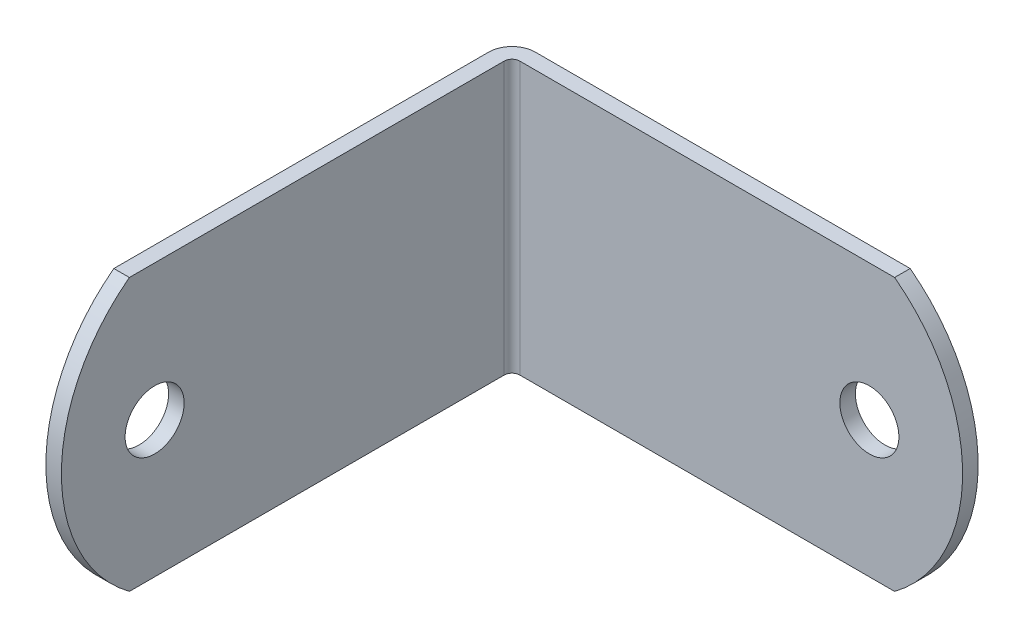
ISO-10303-21;
HEADER;
FILE_DESCRIPTION(('STEP AP214'),'2;1');
FILE_NAME('part.step','',(''),(''),'','','');
FILE_SCHEMA(('AUTOMOTIVE_DESIGN { 1 0 10303 214 1 1 1 1 }'));
ENDSEC;
DATA;
#1=APPLICATION_CONTEXT('core data for automotive mechanical design processes');
#2=APPLICATION_PROTOCOL_DEFINITION('international standard','automotive_design',2000,#1);
#3=PRODUCT_CONTEXT('',#1,'mechanical');
#4=PRODUCT('Part','Part','',(#3));
#5=PRODUCT_RELATED_PRODUCT_CATEGORY('part','',(#4));
#6=PRODUCT_DEFINITION_FORMATION('','',#4);
#7=PRODUCT_DEFINITION_CONTEXT('part definition',#1,'design');
#8=PRODUCT_DEFINITION('design','',#6,#7);
#9=PRODUCT_DEFINITION_SHAPE('','',#8);
#10=(LENGTH_UNIT() NAMED_UNIT(*) SI_UNIT(.MILLI.,.METRE.));
#11=(NAMED_UNIT(*) PLANE_ANGLE_UNIT() SI_UNIT($,.RADIAN.));
#12=(NAMED_UNIT(*) SI_UNIT($,.STERADIAN.) SOLID_ANGLE_UNIT());
#13=UNCERTAINTY_MEASURE_WITH_UNIT(LENGTH_MEASURE(1.E-05),#10,'distance_accuracy_value','');
#14=(GEOMETRIC_REPRESENTATION_CONTEXT(3) GLOBAL_UNCERTAINTY_ASSIGNED_CONTEXT((#13)) GLOBAL_UNIT_ASSIGNED_CONTEXT((#10,
#11,#12)) REPRESENTATION_CONTEXT('',''));
#15=CARTESIAN_POINT('',(0.,0.,0.));
#16=DIRECTION('',(0.,0.,1.));
#17=DIRECTION('',(1.,0.,0.));
#18=AXIS2_PLACEMENT_3D('',#15,#16,#17);
#19=CARTESIAN_POINT('',(1.905,11.1125,1.27));
#20=DIRECTION('',(0.,0.,-1.));
#21=DIRECTION('',(-1.,0.,0.));
#22=AXIS2_PLACEMENT_3D('',#19,#20,#21);
#23=PLANE('',#22);
#24=CARTESIAN_POINT('',(30.48,0.,1.27));
#25=DIRECTION('',(0.,0.,-1.));
#26=DIRECTION('',(-1.,0.,0.));
#27=AXIS2_PLACEMENT_3D('',#24,#25,#26);
#28=CIRCLE('',#27,2.413);
#29=CARTESIAN_POINT('',(28.067,0.,1.27000000000001));
#30=VERTEX_POINT('',#29);
#31=EDGE_CURVE('E187',#30,#30,#28,.F.);
#32=ORIENTED_EDGE('',*,*,#31,.F.);
#33=EDGE_LOOP('',(#32));
#34=FACE_BOUND('',#33,.T.);
#35=CARTESIAN_POINT('',(24.209375,0.,1.26999999999999));
#36=DIRECTION('',(0.,0.,-1.));
#37=DIRECTION('',(-1.,0.,0.));
#38=AXIS2_PLACEMENT_3D('',#35,#36,#37);
#39=CIRCLE('',#38,13.890625);
#40=CARTESIAN_POINT('',(32.54375,11.1125,1.26999999999999));
#41=VERTEX_POINT('',#40);
#42=CARTESIAN_POINT('',(32.54375,-11.1125,1.27));
#43=VERTEX_POINT('',#42);
#44=EDGE_CURVE('E50',#41,#43,#39,.T.);
#45=ORIENTED_EDGE('',*,*,#44,.F.);
#46=DIRECTION('',(1.,0.,0.));
#47=VECTOR('',#46,1.);
#48=CARTESIAN_POINT('',(1.905,11.1125,1.27));
#49=LINE('',#48,#47);
#50=CARTESIAN_POINT('',(1.905,11.1125,1.27));
#51=VERTEX_POINT('',#50);
#52=EDGE_CURVE('E110',#51,#41,#49,.T.);
#53=ORIENTED_EDGE('',*,*,#52,.F.);
#54=DIRECTION('',(0.,-1.,0.));
#55=VECTOR('',#54,1.);
#56=CARTESIAN_POINT('',(1.905,11.1125,1.27));
#57=LINE('',#56,#55);
#58=CARTESIAN_POINT('',(1.905,-11.1125,1.27));
#59=VERTEX_POINT('',#58);
#60=EDGE_CURVE('E136',#51,#59,#57,.T.);
#61=ORIENTED_EDGE('',*,*,#60,.T.);
#62=DIRECTION('',(1.,0.,0.));
#63=VECTOR('',#62,1.);
#64=CARTESIAN_POINT('',(1.905,-11.1125,1.27));
#65=LINE('',#64,#63);
#66=EDGE_CURVE('E112',#59,#43,#65,.T.);
#67=ORIENTED_EDGE('',*,*,#66,.T.);
#68=EDGE_LOOP('',(#45,#53,#61,#67));
#69=FACE_BOUND('',#68,.T.);
#70=ADVANCED_FACE('F36',(#34,#69),#23,.F.);
#71=CARTESIAN_POINT('',(1.905,11.1125,0.));
#72=DIRECTION('',(0.,0.,-1.));
#73=DIRECTION('',(-1.,0.,0.));
#74=AXIS2_PLACEMENT_3D('',#71,#72,#73);
#75=PLANE('',#74);
#76=CARTESIAN_POINT('',(30.48,0.,0.));
#77=DIRECTION('',(0.,0.,1.));
#78=DIRECTION('',(1.,0.,0.));
#79=AXIS2_PLACEMENT_3D('',#76,#77,#78);
#80=CIRCLE('',#79,2.413);
#81=CARTESIAN_POINT('',(28.067,0.,0.));
#82=VERTEX_POINT('',#81);
#83=EDGE_CURVE('E184',#82,#82,#80,.T.);
#84=ORIENTED_EDGE('',*,*,#83,.T.);
#85=EDGE_LOOP('',(#84));
#86=FACE_BOUND('',#85,.T.);
#87=DIRECTION('',(1.,0.,0.));
#88=VECTOR('',#87,1.);
#89=CARTESIAN_POINT('',(1.905,11.1125,0.));
#90=LINE('',#89,#88);
#91=CARTESIAN_POINT('',(1.905,11.1125,0.));
#92=VERTEX_POINT('',#91);
#93=CARTESIAN_POINT('',(32.54375,11.1125,0.));
#94=VERTEX_POINT('',#93);
#95=EDGE_CURVE('E118',#92,#94,#90,.T.);
#96=ORIENTED_EDGE('',*,*,#95,.T.);
#97=CARTESIAN_POINT('',(24.209375,0.,0.));
#98=DIRECTION('',(0.,0.,-1.));
#99=DIRECTION('',(-1.,0.,0.));
#100=AXIS2_PLACEMENT_3D('',#97,#98,#99);
#101=CIRCLE('',#100,13.890625);
#102=CARTESIAN_POINT('',(32.54375,-11.1125,0.));
#103=VERTEX_POINT('',#102);
#104=EDGE_CURVE('E101',#94,#103,#101,.T.);
#105=ORIENTED_EDGE('',*,*,#104,.T.);
#106=DIRECTION('',(1.,0.,0.));
#107=VECTOR('',#106,1.);
#108=CARTESIAN_POINT('',(1.905,-11.1125,0.));
#109=LINE('',#108,#107);
#110=CARTESIAN_POINT('',(1.905,-11.1125,0.));
#111=VERTEX_POINT('',#110);
#112=EDGE_CURVE('E138',#111,#103,#109,.T.);
#113=ORIENTED_EDGE('',*,*,#112,.F.);
#114=DIRECTION('',(0.,-1.,0.));
#115=VECTOR('',#114,1.);
#116=CARTESIAN_POINT('',(1.905,11.1125,0.));
#117=LINE('',#116,#115);
#118=EDGE_CURVE('E155',#92,#111,#117,.T.);
#119=ORIENTED_EDGE('',*,*,#118,.F.);
#120=EDGE_LOOP('',(#96,#105,#113,#119));
#121=FACE_BOUND('',#120,.T.);
#122=ADVANCED_FACE('F178',(#86,#121),#75,.T.);
#123=CARTESIAN_POINT('',(1.905,11.1125,1.905));
#124=DIRECTION('',(0.,-1.,0.));
#125=DIRECTION('',(-1.,0.,0.));
#126=AXIS2_PLACEMENT_3D('',#123,#124,#125);
#127=PLANE('',#126);
#128=DIRECTION('',(0.,0.,-1.));
#129=VECTOR('',#128,1.);
#130=CARTESIAN_POINT('',(32.54375,11.1125,74.4440652605344));
#131=LINE('',#130,#129);
#132=EDGE_CURVE('E99',#41,#94,#131,.T.);
#133=ORIENTED_EDGE('',*,*,#132,.T.);
#134=ORIENTED_EDGE('',*,*,#95,.F.);
#135=CARTESIAN_POINT('',(1.905,11.1125,1.905));
#136=DIRECTION('',(0.,-1.,0.));
#137=DIRECTION('',(0.,0.,1.));
#138=AXIS2_PLACEMENT_3D('',#135,#136,#137);
#139=CIRCLE('',#138,1.905);
#140=CARTESIAN_POINT('',(0.,11.1125,1.905));
#141=VERTEX_POINT('',#140);
#142=EDGE_CURVE('E121',#141,#92,#139,.T.);
#143=ORIENTED_EDGE('',*,*,#142,.F.);
#144=DIRECTION('',(0.,0.,-1.));
#145=VECTOR('',#144,1.);
#146=CARTESIAN_POINT('',(0.,11.1125,38.1));
#147=LINE('',#146,#145);
#148=CARTESIAN_POINT('',(0.,11.1125,32.54375));
#149=VERTEX_POINT('',#148);
#150=EDGE_CURVE('E131',#149,#141,#147,.T.);
#151=ORIENTED_EDGE('',*,*,#150,.F.);
#152=DIRECTION('',(-1.,0.,0.));
#153=VECTOR('',#152,1.);
#154=CARTESIAN_POINT('',(120.164065260534,11.1125,32.54375));
#155=LINE('',#154,#153);
#156=CARTESIAN_POINT('',(1.27,11.1125,32.54375));
#157=VERTEX_POINT('',#156);
#158=EDGE_CURVE('E57',#157,#149,#155,.T.);
#159=ORIENTED_EDGE('',*,*,#158,.F.);
#160=DIRECTION('',(0.,0.,-1.));
#161=VECTOR('',#160,1.);
#162=CARTESIAN_POINT('',(1.27,11.1125,38.1));
#163=LINE('',#162,#161);
#164=CARTESIAN_POINT('',(1.27,11.1125,1.905));
#165=VERTEX_POINT('',#164);
#166=EDGE_CURVE('E133',#157,#165,#163,.T.);
#167=ORIENTED_EDGE('',*,*,#166,.T.);
#168=CARTESIAN_POINT('',(1.905,11.1125,1.905));
#169=DIRECTION('',(0.,1.,0.));
#170=DIRECTION('',(1.,0.,0.));
#171=AXIS2_PLACEMENT_3D('',#168,#169,#170);
#172=CIRCLE('',#171,0.635);
#173=EDGE_CURVE('E116',#165,#51,#172,.F.);
#174=ORIENTED_EDGE('',*,*,#173,.T.);
#175=ORIENTED_EDGE('',*,*,#52,.T.);
#176=EDGE_LOOP('',(#133,#134,#143,#151,#159,#167,#174,#175));
#177=FACE_BOUND('',#176,.T.);
#178=ADVANCED_FACE('F114',(#177),#127,.F.);
#179=CARTESIAN_POINT('',(1.905,-11.1125,1.905));
#180=DIRECTION('',(0.,-1.,0.));
#181=DIRECTION('',(-1.,0.,0.));
#182=AXIS2_PLACEMENT_3D('',#179,#180,#181);
#183=PLANE('',#182);
#184=ORIENTED_EDGE('',*,*,#112,.T.);
#185=DIRECTION('',(0.,0.,-1.));
#186=VECTOR('',#185,1.);
#187=CARTESIAN_POINT('',(32.54375,-11.1125,74.4440652605344));
#188=LINE('',#187,#186);
#189=EDGE_CURVE('E11',#103,#43,#188,.F.);
#190=ORIENTED_EDGE('',*,*,#189,.T.);
#191=ORIENTED_EDGE('',*,*,#66,.F.);
#192=CARTESIAN_POINT('',(1.905,-11.1125,1.905));
#193=DIRECTION('',(0.,1.,0.));
#194=DIRECTION('',(1.,0.,0.));
#195=AXIS2_PLACEMENT_3D('',#192,#193,#194);
#196=CIRCLE('',#195,0.635);
#197=CARTESIAN_POINT('',(1.27,-11.1125,1.905));
#198=VERTEX_POINT('',#197);
#199=EDGE_CURVE('E119',#198,#59,#196,.F.);
#200=ORIENTED_EDGE('',*,*,#199,.F.);
#201=DIRECTION('',(0.,0.,-1.));
#202=VECTOR('',#201,1.);
#203=CARTESIAN_POINT('',(1.27,-11.1125,38.1));
#204=LINE('',#203,#202);
#205=CARTESIAN_POINT('',(1.26999999999999,-11.1125,32.54375));
#206=VERTEX_POINT('',#205);
#207=EDGE_CURVE('E123',#206,#198,#204,.T.);
#208=ORIENTED_EDGE('',*,*,#207,.F.);
#209=DIRECTION('',(-1.,0.,0.));
#210=VECTOR('',#209,1.);
#211=CARTESIAN_POINT('',(120.164065260534,-11.1125,32.54375));
#212=LINE('',#211,#210);
#213=CARTESIAN_POINT('',(0.,-11.1125,32.54375));
#214=VERTEX_POINT('',#213);
#215=EDGE_CURVE('E43',#214,#206,#212,.F.);
#216=ORIENTED_EDGE('',*,*,#215,.F.);
#217=DIRECTION('',(0.,0.,-1.));
#218=VECTOR('',#217,1.);
#219=CARTESIAN_POINT('',(0.,-11.1125,38.1));
#220=LINE('',#219,#218);
#221=CARTESIAN_POINT('',(0.,-11.1125,1.905));
#222=VERTEX_POINT('',#221);
#223=EDGE_CURVE('E145',#214,#222,#220,.T.);
#224=ORIENTED_EDGE('',*,*,#223,.T.);
#225=CARTESIAN_POINT('',(1.905,-11.1125,1.905));
#226=DIRECTION('',(0.,-1.,0.));
#227=DIRECTION('',(0.,0.,1.));
#228=AXIS2_PLACEMENT_3D('',#225,#226,#227);
#229=CIRCLE('',#228,1.905);
#230=EDGE_CURVE('E142',#222,#111,#229,.T.);
#231=ORIENTED_EDGE('',*,*,#230,.T.);
#232=EDGE_LOOP('',(#184,#190,#191,#200,#208,#216,#224,#231));
#233=FACE_BOUND('',#232,.T.);
#234=ADVANCED_FACE('F166',(#233),#183,.T.);
#235=CARTESIAN_POINT('',(1.905,11.1125,1.905));
#236=DIRECTION('',(0.,-1.,0.));
#237=DIRECTION('',(0.,0.,-1.));
#238=AXIS2_PLACEMENT_3D('',#235,#236,#237);
#239=CYLINDRICAL_SURFACE('',#238,1.905);
#240=ORIENTED_EDGE('',*,*,#230,.F.);
#241=DIRECTION('',(0.,-1.,0.));
#242=VECTOR('',#241,1.);
#243=CARTESIAN_POINT('',(0.,11.1125,1.905));
#244=LINE('',#243,#242);
#245=EDGE_CURVE('E152',#141,#222,#244,.T.);
#246=ORIENTED_EDGE('',*,*,#245,.F.);
#247=ORIENTED_EDGE('',*,*,#142,.T.);
#248=ORIENTED_EDGE('',*,*,#118,.T.);
#249=EDGE_LOOP('',(#240,#246,#247,#248));
#250=FACE_BOUND('',#249,.T.);
#251=ADVANCED_FACE('F175',(#250),#239,.T.);
#252=CARTESIAN_POINT('',(0.,11.1125,38.1));
#253=DIRECTION('',(-1.,0.,0.));
#254=DIRECTION('',(0.,0.,1.));
#255=AXIS2_PLACEMENT_3D('',#252,#253,#254);
#256=PLANE('',#255);
#257=CARTESIAN_POINT('',(0.,0.,24.209375));
#258=DIRECTION('',(-1.,0.,0.));
#259=DIRECTION('',(0.,0.,1.));
#260=AXIS2_PLACEMENT_3D('',#257,#258,#259);
#261=CIRCLE('',#260,13.890625);
#262=EDGE_CURVE('E162',#149,#214,#261,.F.);
#263=ORIENTED_EDGE('',*,*,#262,.F.);
#264=ORIENTED_EDGE('',*,*,#150,.T.);
#265=ORIENTED_EDGE('',*,*,#245,.T.);
#266=ORIENTED_EDGE('',*,*,#223,.F.);
#267=EDGE_LOOP('',(#263,#264,#265,#266));
#268=FACE_BOUND('',#267,.T.);
#269=CARTESIAN_POINT('',(0.,0.,30.48));
#270=DIRECTION('',(1.,0.,0.));
#271=DIRECTION('',(0.,0.,-1.));
#272=AXIS2_PLACEMENT_3D('',#269,#270,#271);
#273=CIRCLE('',#272,2.413);
#274=CARTESIAN_POINT('',(0.,0.,28.067));
#275=VERTEX_POINT('',#274);
#276=EDGE_CURVE('E139',#275,#275,#273,.T.);
#277=ORIENTED_EDGE('',*,*,#276,.T.);
#278=EDGE_LOOP('',(#277));
#279=FACE_BOUND('',#278,.T.);
#280=ADVANCED_FACE('F169',(#268,#279),#256,.T.);
#281=CARTESIAN_POINT('',(1.27,11.1125,38.1));
#282=DIRECTION('',(-1.,0.,0.));
#283=DIRECTION('',(0.,0.,1.));
#284=AXIS2_PLACEMENT_3D('',#281,#282,#283);
#285=PLANE('',#284);
#286=CARTESIAN_POINT('',(1.27,0.,30.48));
#287=DIRECTION('',(1.,0.,0.));
#288=DIRECTION('',(0.,0.,-1.));
#289=AXIS2_PLACEMENT_3D('',#286,#287,#288);
#290=CIRCLE('',#289,2.413);
#291=CARTESIAN_POINT('',(1.27,0.,28.067));
#292=VERTEX_POINT('',#291);
#293=EDGE_CURVE('E126',#292,#292,#290,.T.);
#294=ORIENTED_EDGE('',*,*,#293,.F.);
#295=EDGE_LOOP('',(#294));
#296=FACE_BOUND('',#295,.T.);
#297=CARTESIAN_POINT('',(1.26999999999999,0.,24.209375));
#298=DIRECTION('',(-1.,0.,0.));
#299=DIRECTION('',(0.,0.,1.));
#300=AXIS2_PLACEMENT_3D('',#297,#298,#299);
#301=CIRCLE('',#300,13.890625);
#302=EDGE_CURVE('E161',#157,#206,#301,.F.);
#303=ORIENTED_EDGE('',*,*,#302,.T.);
#304=ORIENTED_EDGE('',*,*,#207,.T.);
#305=DIRECTION('',(0.,-1.,0.));
#306=VECTOR('',#305,1.);
#307=CARTESIAN_POINT('',(1.27,11.1125,1.905));
#308=LINE('',#307,#306);
#309=EDGE_CURVE('E149',#165,#198,#308,.T.);
#310=ORIENTED_EDGE('',*,*,#309,.F.);
#311=ORIENTED_EDGE('',*,*,#166,.F.);
#312=EDGE_LOOP('',(#303,#304,#310,#311));
#313=FACE_BOUND('',#312,.T.);
#314=ADVANCED_FACE('F196',(#296,#313),#285,.F.);
#315=CARTESIAN_POINT('',(1.905,11.1125,1.905));
#316=DIRECTION('',(0.,-1.,0.));
#317=DIRECTION('',(0.,0.,-1.));
#318=AXIS2_PLACEMENT_3D('',#315,#316,#317);
#319=CYLINDRICAL_SURFACE('',#318,0.635);
#320=ORIENTED_EDGE('',*,*,#199,.T.);
#321=ORIENTED_EDGE('',*,*,#60,.F.);
#322=ORIENTED_EDGE('',*,*,#173,.F.);
#323=ORIENTED_EDGE('',*,*,#309,.T.);
#324=EDGE_LOOP('',(#320,#321,#322,#323));
#325=FACE_BOUND('',#324,.T.);
#326=ADVANCED_FACE('F199',(#325),#319,.F.);
#327=CARTESIAN_POINT('',(0.,0.,30.48));
#328=DIRECTION('',(1.,0.,0.));
#329=DIRECTION('',(0.,0.,-1.));
#330=AXIS2_PLACEMENT_3D('',#327,#328,#329);
#331=CYLINDRICAL_SURFACE('',#330,2.413);
#332=ORIENTED_EDGE('',*,*,#276,.F.);
#333=EDGE_LOOP('',(#332));
#334=FACE_BOUND('',#333,.T.);
#335=ORIENTED_EDGE('',*,*,#293,.T.);
#336=EDGE_LOOP('',(#335));
#337=FACE_BOUND('',#336,.T.);
#338=ADVANCED_FACE('F194',(#334,#337),#331,.F.);
#339=CARTESIAN_POINT('',(30.48,0.,38.1));
#340=DIRECTION('',(0.,0.,-1.));
#341=DIRECTION('',(-1.,0.,0.));
#342=AXIS2_PLACEMENT_3D('',#339,#340,#341);
#343=CYLINDRICAL_SURFACE('',#342,2.413);
#344=CARTESIAN_POINT('',(28.067,0.,0.));
#345=CARTESIAN_POINT('',(28.067,0.,0.0132291666666678));
#346=CARTESIAN_POINT('',(28.067,0.,0.0264583333333355));
#347=CARTESIAN_POINT('',(28.067,0.,0.0529166666666687));
#348=CARTESIAN_POINT('',(28.067,0.,0.0661458333333341));
#349=CARTESIAN_POINT('',(28.067,0.,0.0926041666666673));
#350=CARTESIAN_POINT('',(28.067,0.,0.105833333333335));
#351=CARTESIAN_POINT('',(28.067,0.,0.132291666666668));
#352=CARTESIAN_POINT('',(28.067,0.,0.145520833333334));
#353=CARTESIAN_POINT('',(28.067,0.,0.171979166666667));
#354=CARTESIAN_POINT('',(28.067,0.,0.185208333333335));
#355=CARTESIAN_POINT('',(28.067,0.,0.211666666666668));
#356=CARTESIAN_POINT('',(28.067,0.,0.224895833333333));
#357=CARTESIAN_POINT('',(28.067,0.,0.251354166666666));
#358=CARTESIAN_POINT('',(28.067,0.,0.264583333333334));
#359=CARTESIAN_POINT('',(28.067,0.,0.291041666666667));
#360=CARTESIAN_POINT('',(28.067,0.,0.304270833333333));
#361=CARTESIAN_POINT('',(28.067,0.,0.330729166666666));
#362=CARTESIAN_POINT('',(28.067,0.,0.343958333333334));
#363=CARTESIAN_POINT('',(28.067,0.,0.370416666666669));
#364=CARTESIAN_POINT('',(28.067,0.,0.383645833333337));
#365=CARTESIAN_POINT('',(28.067,0.,0.41010416666667));
#366=CARTESIAN_POINT('',(28.067,0.,0.423333333333336));
#367=CARTESIAN_POINT('',(28.067,0.,0.449791666666669));
#368=CARTESIAN_POINT('',(28.067,0.,0.463020833333337));
#369=CARTESIAN_POINT('',(28.067,0.,0.48947916666667));
#370=CARTESIAN_POINT('',(28.067,0.,0.502708333333335));
#371=CARTESIAN_POINT('',(28.067,0.,0.529166666666669));
#372=CARTESIAN_POINT('',(28.067,0.,0.542395833333336));
#373=CARTESIAN_POINT('',(28.067,0.,0.568854166666669));
#374=CARTESIAN_POINT('',(28.067,0.,0.582083333333335));
#375=CARTESIAN_POINT('',(28.067,0.,0.608541666666668));
#376=CARTESIAN_POINT('',(28.067,0.,0.621770833333336));
#377=CARTESIAN_POINT('',(28.067,0.,0.648229166666671));
#378=CARTESIAN_POINT('',(28.067,0.,0.661458333333339));
#379=CARTESIAN_POINT('',(28.067,0.,0.687916666666672));
#380=CARTESIAN_POINT('',(28.067,0.,0.701145833333338));
#381=CARTESIAN_POINT('',(28.067,0.,0.727604166666671));
#382=CARTESIAN_POINT('',(28.067,0.,0.740833333333339));
#383=CARTESIAN_POINT('',(28.067,0.,0.767291666666672));
#384=CARTESIAN_POINT('',(28.067,0.,0.780520833333337));
#385=CARTESIAN_POINT('',(28.067,0.,0.806979166666671));
#386=CARTESIAN_POINT('',(28.067,0.,0.820208333333338));
#387=CARTESIAN_POINT('',(28.067,0.,0.846666666666671));
#388=CARTESIAN_POINT('',(28.067,0.,0.859895833333337));
#389=CARTESIAN_POINT('',(28.067,0.,0.88635416666667));
#390=CARTESIAN_POINT('',(28.067,0.,0.899583333333338));
#391=CARTESIAN_POINT('',(28.067,0.,0.926041666666673));
#392=CARTESIAN_POINT('',(28.067,0.,0.939270833333341));
#393=CARTESIAN_POINT('',(28.067,0.,0.965729166666674));
#394=CARTESIAN_POINT('',(28.067,0.,0.97895833333334));
#395=CARTESIAN_POINT('',(28.067,0.,1.00541666666667));
#396=CARTESIAN_POINT('',(28.067,0.,1.01864583333334));
#397=CARTESIAN_POINT('',(28.067,0.,1.04510416666667));
#398=CARTESIAN_POINT('',(28.067,0.,1.05833333333334));
#399=CARTESIAN_POINT('',(28.067,0.,1.08479166666667));
#400=CARTESIAN_POINT('',(28.067,0.,1.09802083333334));
#401=CARTESIAN_POINT('',(28.067,0.,1.12447916666667));
#402=CARTESIAN_POINT('',(28.067,0.,1.13770833333334));
#403=CARTESIAN_POINT('',(28.067,0.,1.16416666666667));
#404=CARTESIAN_POINT('',(28.067,0.,1.17739583333334));
#405=CARTESIAN_POINT('',(28.067,0.,1.20385416666667));
#406=CARTESIAN_POINT('',(28.067,0.,1.21708333333334));
#407=CARTESIAN_POINT('',(28.067,0.,1.24354166666667));
#408=CARTESIAN_POINT('',(28.067,0.,1.25677083333334));
#409=CARTESIAN_POINT('',(28.067,0.,1.27000000000001));
#410=B_SPLINE_CURVE_WITH_KNOTS('',3,(#344,#345,#346,#347,#348,#349,#350,#351,#352,#353,#354,
#355,#356,#357,#358,#359,#360,#361,#362,#363,#364,#365,#366,#367,#368,#369,#370,#371,#372,#373,
#374,#375,#376,#377,#378,#379,#380,#381,#382,#383,#384,#385,#386,#387,#388,#389,#390,#391,#392,
#393,#394,#395,#396,#397,#398,#399,#400,#401,#402,#403,#404,#405,#406,#407,#408,#409),
.UNSPECIFIED.,.F.,.F.,(4,2,2,2,2,2,2,2,2,2,2,2,2,2,2,2,2,2,2,2,2,2,2,2,2,2,2,2,2,2,2,2,4),(0.,
0.0396875000000033,0.0793749999999996,0.119062500000003,0.158749999999999,0.198437500000002,
0.238124999999999,0.277812500000002,0.317499999999998,0.357187500000002,0.396875000000005,
0.436562500000001,0.476250000000004,0.515937500000001,0.555625000000004,0.5953125,
0.635000000000004,0.674687500000007,0.714375000000003,0.754062500000007,0.793750000000003,
0.833437500000006,0.873125000000002,0.912812500000006,0.952500000000009,0.992187500000005,
1.03187500000001,1.0715625,1.11125000000001,1.1509375,1.19062500000001,1.2303125,
1.27000000000001),.UNSPECIFIED.);
#411=EDGE_CURVE('BSEAM208',#82,#30,#410,.T.);
#412=ORIENTED_EDGE('',*,*,#83,.F.);
#413=ORIENTED_EDGE('',*,*,#31,.T.);
#414=ORIENTED_EDGE('',*,*,#411,.T.);
#415=ORIENTED_EDGE('',*,*,#411,.F.);
#416=EDGE_LOOP('',(#412,#414,#413,#415));
#417=FACE_BOUND('',#416,.T.);
#418=ADVANCED_FACE('F208',(#417),#343,.F.);
#419=CARTESIAN_POINT('',(120.164065260534,0.,24.209375));
#420=DIRECTION('',(-1.,0.,0.));
#421=DIRECTION('',(0.,0.,1.));
#422=AXIS2_PLACEMENT_3D('',#419,#420,#421);
#423=CYLINDRICAL_SURFACE('',#422,13.890625);
#424=ORIENTED_EDGE('',*,*,#215,.T.);
#425=ORIENTED_EDGE('',*,*,#302,.F.);
#426=ORIENTED_EDGE('',*,*,#158,.T.);
#427=ORIENTED_EDGE('',*,*,#262,.T.);
#428=EDGE_LOOP('',(#424,#425,#426,#427));
#429=FACE_BOUND('',#428,.T.);
#430=ADVANCED_FACE('F160',(#429),#423,.T.);
#431=CARTESIAN_POINT('',(24.209375,0.,74.4440652605344));
#432=DIRECTION('',(0.,0.,-1.));
#433=DIRECTION('',(-1.,0.,0.));
#434=AXIS2_PLACEMENT_3D('',#431,#432,#433);
#435=CYLINDRICAL_SURFACE('',#434,13.890625);
#436=ORIENTED_EDGE('',*,*,#132,.F.);
#437=ORIENTED_EDGE('',*,*,#44,.T.);
#438=ORIENTED_EDGE('',*,*,#189,.F.);
#439=ORIENTED_EDGE('',*,*,#104,.F.);
#440=EDGE_LOOP('',(#436,#437,#438,#439));
#441=FACE_BOUND('',#440,.T.);
#442=ADVANCED_FACE('F100',(#441),#435,.T.);
#443=CLOSED_SHELL('',(#70,#122,#178,#234,#251,#280,#314,#326,#338,#418,#430,#442));
#444=MANIFOLD_SOLID_BREP('B2',#443);
#445=ADVANCED_BREP_SHAPE_REPRESENTATION('',(#18,#444),#14);
#446=SHAPE_DEFINITION_REPRESENTATION(#9,#445);
ENDSEC;
END-ISO-10303-21;
